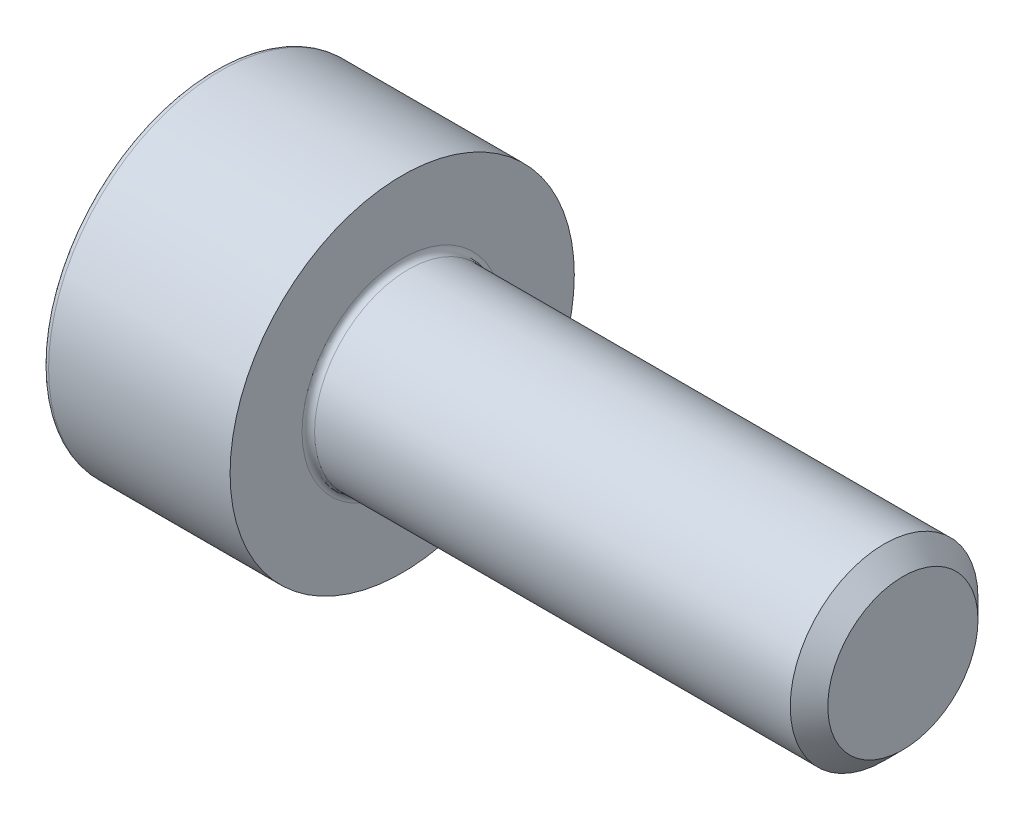
ISO-10303-21;
HEADER;
FILE_DESCRIPTION(('STEP AP214'),'2;1');
FILE_NAME('part.step','',(''),(''),'','','');
FILE_SCHEMA(('AUTOMOTIVE_DESIGN { 1 0 10303 214 1 1 1 1 }'));
ENDSEC;
DATA;
#1=APPLICATION_CONTEXT('core data for automotive mechanical design processes');
#2=APPLICATION_PROTOCOL_DEFINITION('international standard','automotive_design',2000,#1);
#3=PRODUCT_CONTEXT('',#1,'mechanical');
#4=PRODUCT('Part','Part','',(#3));
#5=PRODUCT_RELATED_PRODUCT_CATEGORY('part','',(#4));
#6=PRODUCT_DEFINITION_FORMATION('','',#4);
#7=PRODUCT_DEFINITION_CONTEXT('part definition',#1,'design');
#8=PRODUCT_DEFINITION('design','',#6,#7);
#9=PRODUCT_DEFINITION_SHAPE('','',#8);
#10=(LENGTH_UNIT() NAMED_UNIT(*) SI_UNIT(.MILLI.,.METRE.));
#11=(NAMED_UNIT(*) PLANE_ANGLE_UNIT() SI_UNIT($,.RADIAN.));
#12=(NAMED_UNIT(*) SI_UNIT($,.STERADIAN.) SOLID_ANGLE_UNIT());
#13=UNCERTAINTY_MEASURE_WITH_UNIT(LENGTH_MEASURE(1.E-05),#10,'distance_accuracy_value','');
#14=(GEOMETRIC_REPRESENTATION_CONTEXT(3) GLOBAL_UNCERTAINTY_ASSIGNED_CONTEXT((#13)) GLOBAL_UNIT_ASSIGNED_CONTEXT((#10,
#11,#12)) REPRESENTATION_CONTEXT('',''));
#15=CARTESIAN_POINT('',(0.,0.,0.));
#16=DIRECTION('',(0.,0.,1.));
#17=DIRECTION('',(1.,0.,0.));
#18=AXIS2_PLACEMENT_3D('',#15,#16,#17);
#19=CARTESIAN_POINT('',(0.,0.,0.));
#20=DIRECTION('',(1.,0.,0.));
#21=DIRECTION('',(0.,0.,-1.));
#22=AXIS2_PLACEMENT_3D('',#19,#20,#21);
#23=CYLINDRICAL_SURFACE('',#22,1.5);
#24=CARTESIAN_POINT('',(10.7,0.,0.));
#25=DIRECTION('',(1.,0.,0.));
#26=DIRECTION('',(0.,0.,-1.));
#27=AXIS2_PLACEMENT_3D('',#24,#25,#26);
#28=CIRCLE('',#27,1.5);
#29=CARTESIAN_POINT('',(10.7,0.,-1.5));
#30=VERTEX_POINT('',#29);
#31=EDGE_CURVE('E11',#30,#30,#28,.F.);
#32=ORIENTED_EDGE('',*,*,#31,.T.);
#33=EDGE_LOOP('',(#32));
#34=FACE_BOUND('',#33,.T.);
#35=CARTESIAN_POINT('',(3.1,0.,0.));
#36=DIRECTION('',(1.,0.,0.));
#37=DIRECTION('',(0.,0.,-1.));
#38=AXIS2_PLACEMENT_3D('',#35,#36,#37);
#39=CIRCLE('',#38,1.5);
#40=CARTESIAN_POINT('',(3.1,0.,-1.5));
#41=VERTEX_POINT('',#40);
#42=EDGE_CURVE('E162',#41,#41,#39,.T.);
#43=ORIENTED_EDGE('',*,*,#42,.T.);
#44=EDGE_LOOP('',(#43));
#45=FACE_BOUND('',#44,.T.);
#46=ADVANCED_FACE('F39',(#34,#45),#23,.T.);
#47=CARTESIAN_POINT('',(1.3,-0.7175,1.24274645443067));
#48=DIRECTION('',(-1.,0.,0.));
#49=DIRECTION('',(0.,0.,1.));
#50=AXIS2_PLACEMENT_3D('',#47,#48,#49);
#51=PLANE('',#50);
#52=DIRECTION('',(0.,1.,0.));
#53=VECTOR('',#52,1.);
#54=CARTESIAN_POINT('',(1.3,0.7175,-1.24274645443067));
#55=LINE('',#54,#53);
#56=CARTESIAN_POINT('',(1.3,0.7175,-1.24274645443067));
#57=VERTEX_POINT('',#56);
#58=CARTESIAN_POINT('',(1.3,-0.7175,-1.24274645443067));
#59=VERTEX_POINT('',#58);
#60=EDGE_CURVE('E101',#57,#59,#55,.F.);
#61=ORIENTED_EDGE('',*,*,#60,.T.);
#62=DIRECTION('',(0.,0.5,-0.866025403784439));
#63=VECTOR('',#62,1.);
#64=CARTESIAN_POINT('',(1.3,-0.7175,-1.24274645443067));
#65=LINE('',#64,#63);
#66=CARTESIAN_POINT('',(1.3,-1.435,0.));
#67=VERTEX_POINT('',#66);
#68=EDGE_CURVE('E103',#59,#67,#65,.F.);
#69=ORIENTED_EDGE('',*,*,#68,.T.);
#70=DIRECTION('',(0.,-0.5,-0.866025403784439));
#71=VECTOR('',#70,1.);
#72=CARTESIAN_POINT('',(1.3,-1.435,0.));
#73=LINE('',#72,#71);
#74=CARTESIAN_POINT('',(1.3,-0.7175,1.24274645443067));
#75=VERTEX_POINT('',#74);
#76=EDGE_CURVE('E106',#67,#75,#73,.F.);
#77=ORIENTED_EDGE('',*,*,#76,.T.);
#78=DIRECTION('',(0.,-1.,0.));
#79=VECTOR('',#78,1.);
#80=CARTESIAN_POINT('',(1.3,-0.7175,1.24274645443067));
#81=LINE('',#80,#79);
#82=CARTESIAN_POINT('',(1.3,0.7175,1.24274645443067));
#83=VERTEX_POINT('',#82);
#84=EDGE_CURVE('E372',#75,#83,#81,.F.);
#85=ORIENTED_EDGE('',*,*,#84,.T.);
#86=DIRECTION('',(0.,-0.5,0.866025403784439));
#87=VECTOR('',#86,1.);
#88=CARTESIAN_POINT('',(1.3,0.7175,1.24274645443067));
#89=LINE('',#88,#87);
#90=CARTESIAN_POINT('',(1.3,1.435,0.));
#91=VERTEX_POINT('',#90);
#92=EDGE_CURVE('E367',#83,#91,#89,.F.);
#93=ORIENTED_EDGE('',*,*,#92,.T.);
#94=DIRECTION('',(0.,0.5,0.866025403784439));
#95=VECTOR('',#94,1.);
#96=CARTESIAN_POINT('',(1.3,1.435,0.));
#97=LINE('',#96,#95);
#98=EDGE_CURVE('E362',#91,#57,#97,.F.);
#99=ORIENTED_EDGE('',*,*,#98,.T.);
#100=EDGE_LOOP('',(#61,#69,#77,#85,#93,#99));
#101=FACE_BOUND('',#100,.T.);
#102=ADVANCED_FACE('F105',(#101),#51,.T.);
#103=CARTESIAN_POINT('',(1.3,-1.435,0.));
#104=DIRECTION('',(0.,-0.866025403784439,0.5));
#105=DIRECTION('',(0.,-0.5,-0.866025403784439));
#106=AXIS2_PLACEMENT_3D('',#103,#104,#105);
#107=PLANE('',#106);
#108=DIRECTION('',(1.,0.,0.));
#109=VECTOR('',#108,1.);
#110=CARTESIAN_POINT('',(1.3,-0.7175,1.24274645443067));
#111=LINE('',#110,#109);
#112=CARTESIAN_POINT('',(0.,-0.7175,1.24274645443067));
#113=VERTEX_POINT('',#112);
#114=EDGE_CURVE('E117',#113,#75,#111,.T.);
#115=ORIENTED_EDGE('',*,*,#114,.T.);
#116=ORIENTED_EDGE('',*,*,#76,.F.);
#117=DIRECTION('',(1.,0.,0.));
#118=VECTOR('',#117,1.);
#119=CARTESIAN_POINT('',(1.3,-1.435,0.));
#120=LINE('',#119,#118);
#121=CARTESIAN_POINT('',(0.,-1.435,0.));
#122=VERTEX_POINT('',#121);
#123=EDGE_CURVE('E111',#67,#122,#120,.F.);
#124=ORIENTED_EDGE('',*,*,#123,.T.);
#125=DIRECTION('',(0.,-0.5,-0.866025403784439));
#126=VECTOR('',#125,1.);
#127=CARTESIAN_POINT('',(0.,-0.7175,1.24274645443067));
#128=LINE('',#127,#126);
#129=EDGE_CURVE('E374',#113,#122,#128,.T.);
#130=ORIENTED_EDGE('',*,*,#129,.F.);
#131=EDGE_LOOP('',(#115,#116,#124,#130));
#132=FACE_BOUND('',#131,.T.);
#133=ADVANCED_FACE('F114',(#132),#107,.F.);
#134=CARTESIAN_POINT('',(1.3,-0.7175,-1.24274645443067));
#135=DIRECTION('',(0.,-0.866025403784439,-0.5));
#136=DIRECTION('',(0.,0.5,-0.866025403784439));
#137=AXIS2_PLACEMENT_3D('',#134,#135,#136);
#138=PLANE('',#137);
#139=ORIENTED_EDGE('',*,*,#123,.F.);
#140=ORIENTED_EDGE('',*,*,#68,.F.);
#141=DIRECTION('',(1.,0.,0.));
#142=VECTOR('',#141,1.);
#143=CARTESIAN_POINT('',(1.3,-0.7175,-1.24274645443067));
#144=LINE('',#143,#142);
#145=CARTESIAN_POINT('',(0.,-0.7175,-1.24274645443067));
#146=VERTEX_POINT('',#145);
#147=EDGE_CURVE('E125',#59,#146,#144,.F.);
#148=ORIENTED_EDGE('',*,*,#147,.T.);
#149=DIRECTION('',(0.,0.5,-0.866025403784439));
#150=VECTOR('',#149,1.);
#151=CARTESIAN_POINT('',(0.,-1.435,0.));
#152=LINE('',#151,#150);
#153=EDGE_CURVE('E122',#122,#146,#152,.T.);
#154=ORIENTED_EDGE('',*,*,#153,.F.);
#155=EDGE_LOOP('',(#139,#140,#148,#154));
#156=FACE_BOUND('',#155,.T.);
#157=ADVANCED_FACE('F120',(#156),#138,.F.);
#158=CARTESIAN_POINT('',(1.3,0.7175,-1.24274645443067));
#159=DIRECTION('',(0.,0.,-1.));
#160=DIRECTION('',(0.,1.,0.));
#161=AXIS2_PLACEMENT_3D('',#158,#159,#160);
#162=PLANE('',#161);
#163=ORIENTED_EDGE('',*,*,#147,.F.);
#164=ORIENTED_EDGE('',*,*,#60,.F.);
#165=DIRECTION('',(1.,0.,0.));
#166=VECTOR('',#165,1.);
#167=CARTESIAN_POINT('',(1.3,0.7175,-1.24274645443067));
#168=LINE('',#167,#166);
#169=CARTESIAN_POINT('',(0.,0.7175,-1.24274645443067));
#170=VERTEX_POINT('',#169);
#171=EDGE_CURVE('E363',#57,#170,#168,.F.);
#172=ORIENTED_EDGE('',*,*,#171,.T.);
#173=DIRECTION('',(0.,1.,0.));
#174=VECTOR('',#173,1.);
#175=CARTESIAN_POINT('',(0.,0.,-1.24274645443067));
#176=LINE('',#175,#174);
#177=EDGE_CURVE('E361',#146,#170,#176,.T.);
#178=ORIENTED_EDGE('',*,*,#177,.F.);
#179=EDGE_LOOP('',(#163,#164,#172,#178));
#180=FACE_BOUND('',#179,.T.);
#181=ADVANCED_FACE('F297',(#180),#162,.F.);
#182=CARTESIAN_POINT('',(1.3,1.435,0.));
#183=DIRECTION('',(0.,0.866025403784439,-0.5));
#184=DIRECTION('',(0.,0.5,0.866025403784439));
#185=AXIS2_PLACEMENT_3D('',#182,#183,#184);
#186=PLANE('',#185);
#187=ORIENTED_EDGE('',*,*,#171,.F.);
#188=ORIENTED_EDGE('',*,*,#98,.F.);
#189=DIRECTION('',(1.,0.,0.));
#190=VECTOR('',#189,1.);
#191=CARTESIAN_POINT('',(1.3,1.435,0.));
#192=LINE('',#191,#190);
#193=CARTESIAN_POINT('',(0.,1.435,0.));
#194=VERTEX_POINT('',#193);
#195=EDGE_CURVE('E369',#91,#194,#192,.F.);
#196=ORIENTED_EDGE('',*,*,#195,.T.);
#197=DIRECTION('',(0.,0.5,0.866025403784439));
#198=VECTOR('',#197,1.);
#199=CARTESIAN_POINT('',(0.,0.7175,-1.24274645443067));
#200=LINE('',#199,#198);
#201=EDGE_CURVE('E393',#170,#194,#200,.T.);
#202=ORIENTED_EDGE('',*,*,#201,.F.);
#203=EDGE_LOOP('',(#187,#188,#196,#202));
#204=FACE_BOUND('',#203,.T.);
#205=ADVANCED_FACE('F289',(#204),#186,.F.);
#206=CARTESIAN_POINT('',(1.3,0.7175,1.24274645443067));
#207=DIRECTION('',(0.,0.866025403784439,0.5));
#208=DIRECTION('',(0.,-0.5,0.866025403784439));
#209=AXIS2_PLACEMENT_3D('',#206,#207,#208);
#210=PLANE('',#209);
#211=ORIENTED_EDGE('',*,*,#195,.F.);
#212=ORIENTED_EDGE('',*,*,#92,.F.);
#213=DIRECTION('',(1.,0.,0.));
#214=VECTOR('',#213,1.);
#215=CARTESIAN_POINT('',(1.3,0.7175,1.24274645443067));
#216=LINE('',#215,#214);
#217=CARTESIAN_POINT('',(0.,0.7175,1.24274645443067));
#218=VERTEX_POINT('',#217);
#219=EDGE_CURVE('E373',#83,#218,#216,.F.);
#220=ORIENTED_EDGE('',*,*,#219,.T.);
#221=DIRECTION('',(0.,-0.5,0.866025403784439));
#222=VECTOR('',#221,1.);
#223=CARTESIAN_POINT('',(0.,1.435,0.));
#224=LINE('',#223,#222);
#225=EDGE_CURVE('E390',#194,#218,#224,.T.);
#226=ORIENTED_EDGE('',*,*,#225,.F.);
#227=EDGE_LOOP('',(#211,#212,#220,#226));
#228=FACE_BOUND('',#227,.T.);
#229=ADVANCED_FACE('F283',(#228),#210,.F.);
#230=CARTESIAN_POINT('',(1.3,-0.7175,1.24274645443067));
#231=DIRECTION('',(0.,0.,1.));
#232=DIRECTION('',(0.,-1.,0.));
#233=AXIS2_PLACEMENT_3D('',#230,#231,#232);
#234=PLANE('',#233);
#235=ORIENTED_EDGE('',*,*,#219,.F.);
#236=ORIENTED_EDGE('',*,*,#84,.F.);
#237=ORIENTED_EDGE('',*,*,#114,.F.);
#238=DIRECTION('',(0.,1.,0.));
#239=VECTOR('',#238,1.);
#240=CARTESIAN_POINT('',(0.,0.,1.24274645443067));
#241=LINE('',#240,#239);
#242=EDGE_CURVE('E389',#218,#113,#241,.F.);
#243=ORIENTED_EDGE('',*,*,#242,.F.);
#244=EDGE_LOOP('',(#235,#236,#237,#243));
#245=FACE_BOUND('',#244,.T.);
#246=ADVANCED_FACE('F277',(#245),#234,.F.);
#247=CARTESIAN_POINT('',(0.,0.,0.));
#248=DIRECTION('',(-1.,0.,0.));
#249=DIRECTION('',(0.,0.,1.));
#250=AXIS2_PLACEMENT_3D('',#247,#248,#249);
#251=PLANE('',#250);
#252=ORIENTED_EDGE('',*,*,#225,.T.);
#253=ORIENTED_EDGE('',*,*,#242,.T.);
#254=ORIENTED_EDGE('',*,*,#129,.T.);
#255=ORIENTED_EDGE('',*,*,#153,.T.);
#256=ORIENTED_EDGE('',*,*,#177,.T.);
#257=ORIENTED_EDGE('',*,*,#201,.T.);
#258=EDGE_LOOP('',(#252,#253,#254,#255,#256,#257));
#259=FACE_BOUND('',#258,.T.);
#260=CARTESIAN_POINT('',(0.,0.,0.));
#261=DIRECTION('',(1.,0.,0.));
#262=DIRECTION('',(0.,0.,-1.));
#263=AXIS2_PLACEMENT_3D('',#260,#261,#262);
#264=CIRCLE('',#263,2.65);
#265=CARTESIAN_POINT('',(0.,0.,-2.65));
#266=VERTEX_POINT('',#265);
#267=CARTESIAN_POINT('',(0.,0.,2.65));
#268=VERTEX_POINT('',#267);
#269=EDGE_CURVE('E386',#266,#268,#264,.T.);
#270=ORIENTED_EDGE('',*,*,#269,.F.);
#271=CARTESIAN_POINT('',(0.,0.,0.));
#272=DIRECTION('',(1.,0.,0.));
#273=DIRECTION('',(0.,0.,1.));
#274=AXIS2_PLACEMENT_3D('',#271,#272,#273);
#275=CIRCLE('',#274,2.65);
#276=EDGE_CURVE('E191',#268,#266,#275,.T.);
#277=ORIENTED_EDGE('',*,*,#276,.F.);
#278=EDGE_LOOP('',(#270,#277));
#279=FACE_BOUND('',#278,.T.);
#280=ADVANCED_FACE('F201',(#259,#279),#251,.T.);
#281=CARTESIAN_POINT('',(0.1,0.,0.));
#282=DIRECTION('',(-1.,0.,0.));
#283=DIRECTION('',(0.,0.,1.));
#284=AXIS2_PLACEMENT_3D('',#281,#282,#283);
#285=TOROIDAL_SURFACE('',#284,2.65,0.1);
#286=CARTESIAN_POINT('',(0.1,0.,0.));
#287=DIRECTION('',(1.,0.,0.));
#288=DIRECTION('',(0.,0.,-1.));
#289=AXIS2_PLACEMENT_3D('',#286,#287,#288);
#290=CIRCLE('',#289,2.75);
#291=CARTESIAN_POINT('',(0.1,0.,-2.75));
#292=VERTEX_POINT('',#291);
#293=EDGE_CURVE('E133',#292,#292,#290,.T.);
#294=ORIENTED_EDGE('',*,*,#293,.F.);
#295=EDGE_LOOP('',(#294));
#296=FACE_BOUND('',#295,.T.);
#297=ORIENTED_EDGE('',*,*,#276,.T.);
#298=ORIENTED_EDGE('',*,*,#269,.T.);
#299=EDGE_LOOP('',(#297,#298));
#300=FACE_BOUND('',#299,.T.);
#301=ADVANCED_FACE('F196',(#296,#300),#285,.T.);
#302=CARTESIAN_POINT('',(0.,0.,0.));
#303=DIRECTION('',(1.,0.,0.));
#304=DIRECTION('',(0.,0.,-1.));
#305=AXIS2_PLACEMENT_3D('',#302,#303,#304);
#306=CYLINDRICAL_SURFACE('',#305,2.75);
#307=ORIENTED_EDGE('',*,*,#293,.T.);
#308=EDGE_LOOP('',(#307));
#309=FACE_BOUND('',#308,.T.);
#310=CARTESIAN_POINT('',(3.,0.,0.));
#311=DIRECTION('',(1.,0.,0.));
#312=DIRECTION('',(0.,0.,-1.));
#313=AXIS2_PLACEMENT_3D('',#310,#311,#312);
#314=CIRCLE('',#313,2.75);
#315=CARTESIAN_POINT('',(3.,0.,-2.75));
#316=VERTEX_POINT('',#315);
#317=EDGE_CURVE('E129',#316,#316,#314,.T.);
#318=ORIENTED_EDGE('',*,*,#317,.F.);
#319=EDGE_LOOP('',(#318));
#320=FACE_BOUND('',#319,.T.);
#321=ADVANCED_FACE('F200',(#309,#320),#306,.T.);
#322=CARTESIAN_POINT('',(3.,2.75,0.));
#323=DIRECTION('',(1.,0.,0.));
#324=DIRECTION('',(0.,0.,-1.));
#325=AXIS2_PLACEMENT_3D('',#322,#323,#324);
#326=PLANE('',#325);
#327=CARTESIAN_POINT('',(3.,0.,0.));
#328=DIRECTION('',(1.,0.,0.));
#329=DIRECTION('',(0.,0.,-1.));
#330=AXIS2_PLACEMENT_3D('',#327,#328,#329);
#331=CIRCLE('',#330,1.6);
#332=CARTESIAN_POINT('',(3.,0.,1.6));
#333=VERTEX_POINT('',#332);
#334=CARTESIAN_POINT('',(3.,0.,-1.6));
#335=VERTEX_POINT('',#334);
#336=EDGE_CURVE('E56',#333,#335,#331,.F.);
#337=ORIENTED_EDGE('',*,*,#336,.T.);
#338=CARTESIAN_POINT('',(3.,0.,0.));
#339=DIRECTION('',(1.,0.,0.));
#340=DIRECTION('',(0.,0.,1.));
#341=AXIS2_PLACEMENT_3D('',#338,#339,#340);
#342=CIRCLE('',#341,1.6);
#343=EDGE_CURVE('E132',#335,#333,#342,.F.);
#344=ORIENTED_EDGE('',*,*,#343,.T.);
#345=EDGE_LOOP('',(#337,#344));
#346=FACE_BOUND('',#345,.T.);
#347=ORIENTED_EDGE('',*,*,#317,.T.);
#348=EDGE_LOOP('',(#347));
#349=FACE_BOUND('',#348,.T.);
#350=ADVANCED_FACE('F153',(#346,#349),#326,.T.);
#351=CARTESIAN_POINT('',(3.1,0.,0.));
#352=DIRECTION('',(1.,0.,0.));
#353=DIRECTION('',(0.,0.,-1.));
#354=AXIS2_PLACEMENT_3D('',#351,#352,#353);
#355=TOROIDAL_SURFACE('',#354,1.6,0.1);
#356=ORIENTED_EDGE('',*,*,#42,.F.);
#357=EDGE_LOOP('',(#356));
#358=FACE_BOUND('',#357,.T.);
#359=ORIENTED_EDGE('',*,*,#343,.F.);
#360=ORIENTED_EDGE('',*,*,#336,.F.);
#361=EDGE_LOOP('',(#359,#360));
#362=FACE_BOUND('',#361,.T.);
#363=ADVANCED_FACE('F141',(#358,#362),#355,.F.);
#364=CARTESIAN_POINT('',(11.,0.,0.));
#365=DIRECTION('',(1.,0.,0.));
#366=DIRECTION('',(0.,0.,-1.));
#367=AXIS2_PLACEMENT_3D('',#364,#365,#366);
#368=PLANE('',#367);
#369=CARTESIAN_POINT('',(11.,0.,0.));
#370=DIRECTION('',(1.,0.,0.));
#371=DIRECTION('',(0.,0.,-1.));
#372=AXIS2_PLACEMENT_3D('',#369,#370,#371);
#373=CIRCLE('',#372,1.2);
#374=CARTESIAN_POINT('',(11.,0.,-1.2));
#375=VERTEX_POINT('',#374);
#376=EDGE_CURVE('E49',#375,#375,#373,.T.);
#377=ORIENTED_EDGE('',*,*,#376,.T.);
#378=EDGE_LOOP('',(#377));
#379=FACE_BOUND('',#378,.T.);
#380=ADVANCED_FACE('F152',(#379),#368,.T.);
#381=CARTESIAN_POINT('',(11.,0.,0.));
#382=DIRECTION('',(-1.,0.,0.));
#383=DIRECTION('',(0.,0.,1.));
#384=AXIS2_PLACEMENT_3D('',#381,#382,#383);
#385=CONICAL_SURFACE('',#384,1.2,0.785398163397447);
#386=ORIENTED_EDGE('',*,*,#31,.F.);
#387=EDGE_LOOP('',(#386));
#388=FACE_BOUND('',#387,.T.);
#389=ORIENTED_EDGE('',*,*,#376,.F.);
#390=EDGE_LOOP('',(#389));
#391=FACE_BOUND('',#390,.T.);
#392=ADVANCED_FACE('F42',(#388,#391),#385,.T.);
#393=CLOSED_SHELL('',(#46,#102,#133,#157,#181,#205,#229,#246,#280,#301,#321,#350,#363,#380,#392));
#394=MANIFOLD_SOLID_BREP('B2',#393);
#395=ADVANCED_BREP_SHAPE_REPRESENTATION('',(#18,#394),#14);
#396=SHAPE_DEFINITION_REPRESENTATION(#9,#395);
ENDSEC;
END-ISO-10303-21;
